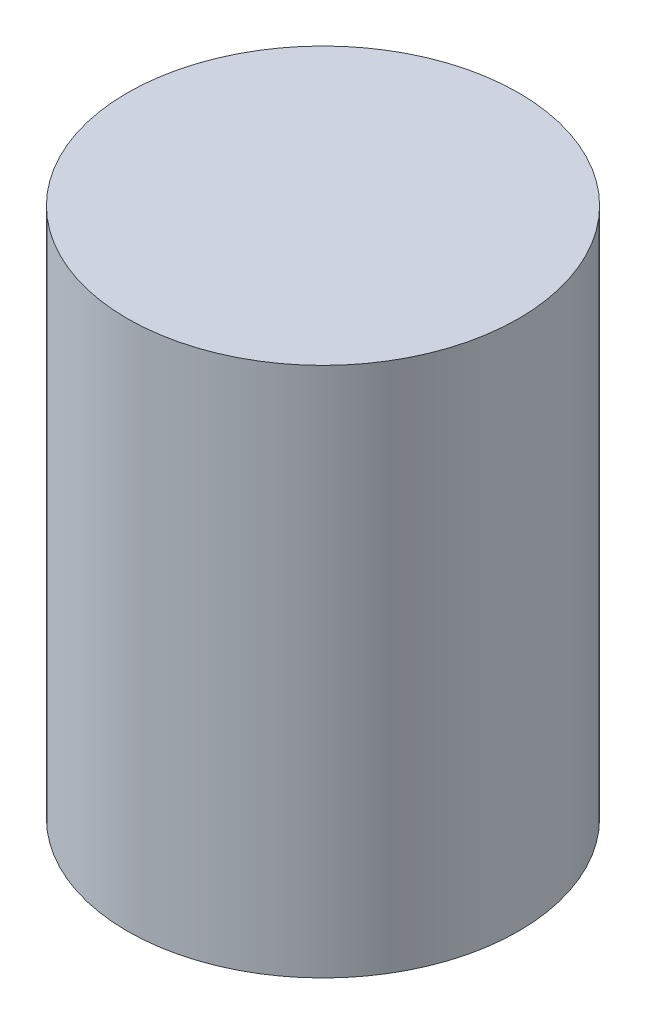
ISO-10303-21;
HEADER;
FILE_DESCRIPTION(('STEP AP214'),'2;1');
FILE_NAME('part.step','',(''),(''),'','','');
FILE_SCHEMA(('AUTOMOTIVE_DESIGN { 1 0 10303 214 1 1 1 1 }'));
ENDSEC;
DATA;
#1=APPLICATION_CONTEXT('core data for automotive mechanical design processes');
#2=APPLICATION_PROTOCOL_DEFINITION('international standard','automotive_design',2000,#1);
#3=PRODUCT_CONTEXT('',#1,'mechanical');
#4=PRODUCT('Part','Part','',(#3));
#5=PRODUCT_RELATED_PRODUCT_CATEGORY('part','',(#4));
#6=PRODUCT_DEFINITION_FORMATION('','',#4);
#7=PRODUCT_DEFINITION_CONTEXT('part definition',#1,'design');
#8=PRODUCT_DEFINITION('design','',#6,#7);
#9=PRODUCT_DEFINITION_SHAPE('','',#8);
#10=(LENGTH_UNIT() NAMED_UNIT(*) SI_UNIT(.MILLI.,.METRE.));
#11=(NAMED_UNIT(*) PLANE_ANGLE_UNIT() SI_UNIT($,.RADIAN.));
#12=(NAMED_UNIT(*) SI_UNIT($,.STERADIAN.) SOLID_ANGLE_UNIT());
#13=UNCERTAINTY_MEASURE_WITH_UNIT(LENGTH_MEASURE(1.E-05),#10,'distance_accuracy_value','');
#14=(GEOMETRIC_REPRESENTATION_CONTEXT(3) GLOBAL_UNCERTAINTY_ASSIGNED_CONTEXT((#13)) GLOBAL_UNIT_ASSIGNED_CONTEXT((#10,
#11,#12)) REPRESENTATION_CONTEXT('',''));
#15=CARTESIAN_POINT('',(0.,0.,0.));
#16=DIRECTION('',(0.,0.,1.));
#17=DIRECTION('',(1.,0.,0.));
#18=AXIS2_PLACEMENT_3D('',#15,#16,#17);
#19=CARTESIAN_POINT('',(0.,21.4,0.));
#20=DIRECTION('',(0.,-1.,0.));
#21=DIRECTION('',(0.,0.,-1.));
#22=AXIS2_PLACEMENT_3D('',#19,#20,#21);
#23=CYLINDRICAL_SURFACE('',#22,7.89);
#24=CARTESIAN_POINT('',(0.,21.4,0.));
#25=DIRECTION('',(0.,1.,0.));
#26=DIRECTION('',(0.,0.,1.));
#27=AXIS2_PLACEMENT_3D('',#24,#25,#26);
#28=CIRCLE('',#27,7.89);
#29=CARTESIAN_POINT('',(0.,21.4,7.89));
#30=VERTEX_POINT('',#29);
#31=EDGE_CURVE('E10',#30,#30,#28,.T.);
#32=ORIENTED_EDGE('',*,*,#31,.F.);
#33=EDGE_LOOP('',(#32));
#34=FACE_BOUND('',#33,.T.);
#35=CARTESIAN_POINT('',(0.,0.,0.));
#36=DIRECTION('',(0.,1.,0.));
#37=DIRECTION('',(0.,0.,1.));
#38=AXIS2_PLACEMENT_3D('',#35,#36,#37);
#39=CIRCLE('',#38,7.89);
#40=CARTESIAN_POINT('',(0.,0.,7.89));
#41=VERTEX_POINT('',#40);
#42=EDGE_CURVE('E42',#41,#41,#39,.T.);
#43=ORIENTED_EDGE('',*,*,#42,.T.);
#44=EDGE_LOOP('',(#43));
#45=FACE_BOUND('',#44,.T.);
#46=ADVANCED_FACE('F39',(#34,#45),#23,.T.);
#47=CARTESIAN_POINT('',(0.,21.4,0.));
#48=DIRECTION('',(0.,1.,0.));
#49=DIRECTION('',(0.,0.,1.));
#50=AXIS2_PLACEMENT_3D('',#47,#48,#49);
#51=PLANE('',#50);
#52=ORIENTED_EDGE('',*,*,#31,.T.);
#53=EDGE_LOOP('',(#52));
#54=FACE_BOUND('',#53,.T.);
#55=ADVANCED_FACE('F56',(#54),#51,.T.);
#56=CARTESIAN_POINT('',(0.,0.,0.));
#57=DIRECTION('',(0.,1.,0.));
#58=DIRECTION('',(0.,0.,1.));
#59=AXIS2_PLACEMENT_3D('',#56,#57,#58);
#60=PLANE('',#59);
#61=ORIENTED_EDGE('',*,*,#42,.F.);
#62=EDGE_LOOP('',(#61));
#63=FACE_BOUND('',#62,.T.);
#64=ADVANCED_FACE('F54',(#63),#60,.F.);
#65=CLOSED_SHELL('',(#46,#55,#64));
#66=MANIFOLD_SOLID_BREP('B2',#65);
#67=ADVANCED_BREP_SHAPE_REPRESENTATION('',(#18,#66),#14);
#68=SHAPE_DEFINITION_REPRESENTATION(#9,#67);
ENDSEC;
END-ISO-10303-21;
